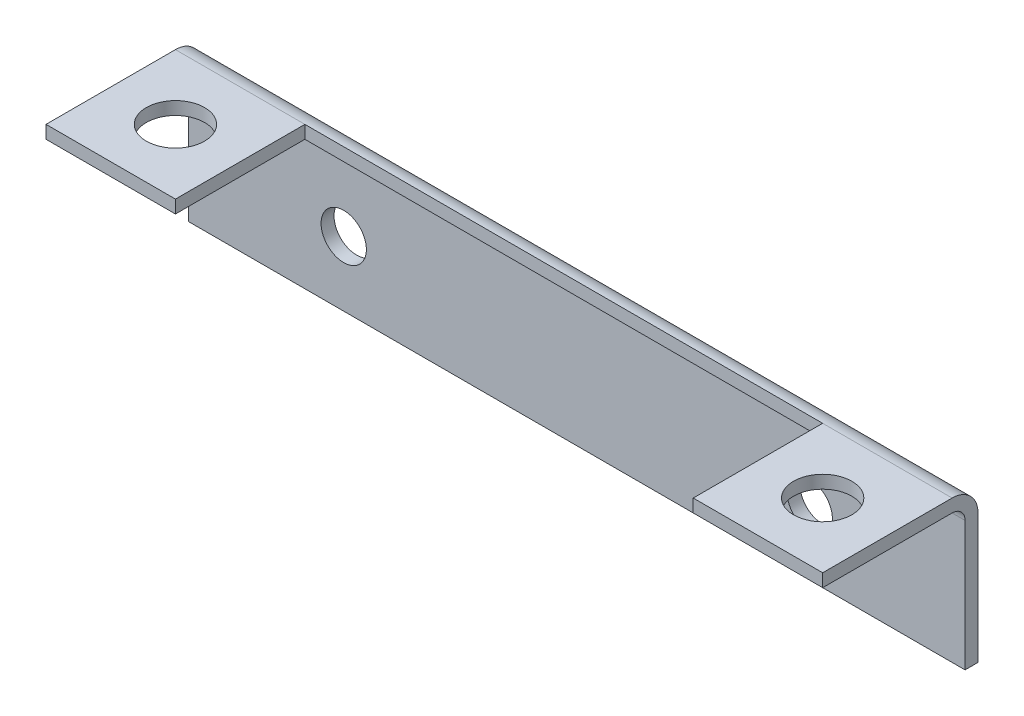
ISO-10303-21;
HEADER;
FILE_DESCRIPTION(('STEP AP214'),'2;1');
FILE_NAME('part.step','',(''),(''),'','','');
FILE_SCHEMA(('AUTOMOTIVE_DESIGN { 1 0 10303 214 1 1 1 1 }'));
ENDSEC;
DATA;
#1=APPLICATION_CONTEXT('core data for automotive mechanical design processes');
#2=APPLICATION_PROTOCOL_DEFINITION('international standard','automotive_design',2000,#1);
#3=PRODUCT_CONTEXT('',#1,'mechanical');
#4=PRODUCT('Part','Part','',(#3));
#5=PRODUCT_RELATED_PRODUCT_CATEGORY('part','',(#4));
#6=PRODUCT_DEFINITION_FORMATION('','',#4);
#7=PRODUCT_DEFINITION_CONTEXT('part definition',#1,'design');
#8=PRODUCT_DEFINITION('design','',#6,#7);
#9=PRODUCT_DEFINITION_SHAPE('','',#8);
#10=(LENGTH_UNIT() NAMED_UNIT(*) SI_UNIT(.MILLI.,.METRE.));
#11=(NAMED_UNIT(*) PLANE_ANGLE_UNIT() SI_UNIT($,.RADIAN.));
#12=(NAMED_UNIT(*) SI_UNIT($,.STERADIAN.) SOLID_ANGLE_UNIT());
#13=UNCERTAINTY_MEASURE_WITH_UNIT(LENGTH_MEASURE(1.E-05),#10,'distance_accuracy_value','');
#14=(GEOMETRIC_REPRESENTATION_CONTEXT(3) GLOBAL_UNCERTAINTY_ASSIGNED_CONTEXT((#13)) GLOBAL_UNIT_ASSIGNED_CONTEXT((#10,
#11,#12)) REPRESENTATION_CONTEXT('',''));
#15=CARTESIAN_POINT('',(0.,0.,0.));
#16=DIRECTION('',(0.,0.,1.));
#17=DIRECTION('',(1.,0.,0.));
#18=AXIS2_PLACEMENT_3D('',#15,#16,#17);
#19=CARTESIAN_POINT('',(0.,6.,5.86902664470768));
#20=DIRECTION('',(0.,-1.,0.));
#21=DIRECTION('',(0.,0.,-1.));
#22=AXIS2_PLACEMENT_3D('',#19,#20,#21);
#23=PLANE('',#22);
#24=CARTESIAN_POINT('',(25.,6.,6.99999999999999));
#25=DIRECTION('',(0.,1.,0.));
#26=DIRECTION('',(0.,0.,1.));
#27=AXIS2_PLACEMENT_3D('',#24,#25,#26);
#28=CIRCLE('',#27,2.25);
#29=CARTESIAN_POINT('',(25.,6.,9.24999999999999));
#30=VERTEX_POINT('',#29);
#31=EDGE_CURVE('E19',#30,#30,#28,.T.);
#32=ORIENTED_EDGE('',*,*,#31,.T.);
#33=EDGE_LOOP('',(#32));
#34=FACE_BOUND('',#33,.T.);
#35=DIRECTION('',(0.,0.,-1.));
#36=VECTOR('',#35,1.);
#37=CARTESIAN_POINT('',(30.,6.,2.));
#38=LINE('',#37,#36);
#39=CARTESIAN_POINT('',(30.,6.,12.));
#40=VERTEX_POINT('',#39);
#41=CARTESIAN_POINT('',(30.,5.99999999999999,2.));
#42=VERTEX_POINT('',#41);
#43=EDGE_CURVE('E59',#40,#42,#38,.T.);
#44=ORIENTED_EDGE('',*,*,#43,.F.);
#45=DIRECTION('',(1.,0.,0.));
#46=VECTOR('',#45,1.);
#47=CARTESIAN_POINT('',(30.,6.,12.));
#48=LINE('',#47,#46);
#49=CARTESIAN_POINT('',(20.,6.,12.));
#50=VERTEX_POINT('',#49);
#51=EDGE_CURVE('E68',#50,#40,#48,.T.);
#52=ORIENTED_EDGE('',*,*,#51,.F.);
#53=DIRECTION('',(0.,0.,-1.));
#54=VECTOR('',#53,1.);
#55=CARTESIAN_POINT('',(20.,6.,2.));
#56=LINE('',#55,#54);
#57=CARTESIAN_POINT('',(20.,5.99999999999999,2.));
#58=VERTEX_POINT('',#57);
#59=EDGE_CURVE('E247',#50,#58,#56,.T.);
#60=ORIENTED_EDGE('',*,*,#59,.T.);
#61=DIRECTION('',(1.,0.,0.));
#62=VECTOR('',#61,1.);
#63=CARTESIAN_POINT('',(0.,5.99999999999999,2.));
#64=LINE('',#63,#62);
#65=EDGE_CURVE('E235',#58,#42,#64,.T.);
#66=ORIENTED_EDGE('',*,*,#65,.T.);
#67=EDGE_LOOP('',(#44,#52,#60,#66));
#68=FACE_BOUND('',#67,.T.);
#69=ADVANCED_FACE('F16',(#34,#68),#23,.T.);
#70=CARTESIAN_POINT('',(0.,6.,5.86902664470768));
#71=DIRECTION('',(0.,-1.,0.));
#72=DIRECTION('',(0.,0.,-1.));
#73=AXIS2_PLACEMENT_3D('',#70,#71,#72);
#74=PLANE('',#73);
#75=CARTESIAN_POINT('',(-25.,6.,6.99999999999999));
#76=DIRECTION('',(0.,1.,0.));
#77=DIRECTION('',(0.,0.,1.));
#78=AXIS2_PLACEMENT_3D('',#75,#76,#77);
#79=CIRCLE('',#78,2.25);
#80=CARTESIAN_POINT('',(-25.,6.,9.24999999999999));
#81=VERTEX_POINT('',#80);
#82=EDGE_CURVE('E224',#81,#81,#79,.T.);
#83=ORIENTED_EDGE('',*,*,#82,.T.);
#84=EDGE_LOOP('',(#83));
#85=FACE_BOUND('',#84,.T.);
#86=DIRECTION('',(0.,0.,1.));
#87=VECTOR('',#86,1.);
#88=CARTESIAN_POINT('',(-30.,5.99999999999999,2.));
#89=LINE('',#88,#87);
#90=CARTESIAN_POINT('',(-30.,5.99999999999999,2.));
#91=VERTEX_POINT('',#90);
#92=CARTESIAN_POINT('',(-30.,5.99999999999999,12.));
#93=VERTEX_POINT('',#92);
#94=EDGE_CURVE('E214',#91,#93,#89,.T.);
#95=ORIENTED_EDGE('',*,*,#94,.F.);
#96=DIRECTION('',(1.,0.,0.));
#97=VECTOR('',#96,1.);
#98=CARTESIAN_POINT('',(0.,5.99999999999999,2.));
#99=LINE('',#98,#97);
#100=CARTESIAN_POINT('',(-20.,5.99999999999999,2.));
#101=VERTEX_POINT('',#100);
#102=EDGE_CURVE('E181',#91,#101,#99,.T.);
#103=ORIENTED_EDGE('',*,*,#102,.T.);
#104=DIRECTION('',(0.,0.,1.));
#105=VECTOR('',#104,1.);
#106=CARTESIAN_POINT('',(-20.,5.99999999999999,12.));
#107=LINE('',#106,#105);
#108=CARTESIAN_POINT('',(-20.,5.99999999999999,12.));
#109=VERTEX_POINT('',#108);
#110=EDGE_CURVE('E225',#101,#109,#107,.T.);
#111=ORIENTED_EDGE('',*,*,#110,.T.);
#112=DIRECTION('',(1.,0.,0.));
#113=VECTOR('',#112,1.);
#114=CARTESIAN_POINT('',(30.,6.,12.));
#115=LINE('',#114,#113);
#116=EDGE_CURVE('E118',#93,#109,#115,.T.);
#117=ORIENTED_EDGE('',*,*,#116,.F.);
#118=EDGE_LOOP('',(#95,#103,#111,#117));
#119=FACE_BOUND('',#118,.T.);
#120=ADVANCED_FACE('F301',(#85,#119),#74,.T.);
#121=CARTESIAN_POINT('',(30.,6.,12.));
#122=DIRECTION('',(0.,0.,1.));
#123=DIRECTION('',(0.,-1.,0.));
#124=AXIS2_PLACEMENT_3D('',#121,#122,#123);
#125=PLANE('',#124);
#126=DIRECTION('',(0.,-1.,0.));
#127=VECTOR('',#126,1.);
#128=CARTESIAN_POINT('',(30.,6.,12.));
#129=LINE('',#128,#127);
#130=CARTESIAN_POINT('',(30.,7.00000000000001,12.));
#131=VERTEX_POINT('',#130);
#132=EDGE_CURVE('E111',#40,#131,#129,.F.);
#133=ORIENTED_EDGE('',*,*,#132,.T.);
#134=DIRECTION('',(1.,0.,0.));
#135=VECTOR('',#134,1.);
#136=CARTESIAN_POINT('',(0.,7.00000000000001,12.));
#137=LINE('',#136,#135);
#138=CARTESIAN_POINT('',(20.,7.00000000000001,12.));
#139=VERTEX_POINT('',#138);
#140=EDGE_CURVE('E180',#131,#139,#137,.F.);
#141=ORIENTED_EDGE('',*,*,#140,.T.);
#142=DIRECTION('',(0.,1.,0.));
#143=VECTOR('',#142,1.);
#144=CARTESIAN_POINT('',(20.,6.99999999999999,12.));
#145=LINE('',#144,#143);
#146=EDGE_CURVE('E250',#139,#50,#145,.F.);
#147=ORIENTED_EDGE('',*,*,#146,.T.);
#148=ORIENTED_EDGE('',*,*,#51,.T.);
#149=EDGE_LOOP('',(#133,#141,#147,#148));
#150=FACE_BOUND('',#149,.T.);
#151=ADVANCED_FACE('F378',(#150),#125,.T.);
#152=CARTESIAN_POINT('',(20.,6.99999999999999,2.));
#153=DIRECTION('',(1.,0.,0.));
#154=DIRECTION('',(0.,0.,-1.));
#155=AXIS2_PLACEMENT_3D('',#152,#153,#154);
#156=PLANE('',#155);
#157=DIRECTION('',(0.,1.,0.));
#158=VECTOR('',#157,1.);
#159=CARTESIAN_POINT('',(20.,6.99999999999999,2.));
#160=LINE('',#159,#158);
#161=CARTESIAN_POINT('',(20.,6.99999999999999,2.));
#162=VERTEX_POINT('',#161);
#163=EDGE_CURVE('E98',#58,#162,#160,.T.);
#164=ORIENTED_EDGE('',*,*,#163,.F.);
#165=ORIENTED_EDGE('',*,*,#59,.F.);
#166=ORIENTED_EDGE('',*,*,#146,.F.);
#167=DIRECTION('',(0.,0.,-1.));
#168=VECTOR('',#167,1.);
#169=CARTESIAN_POINT('',(20.,7.,5.86902664470768));
#170=LINE('',#169,#168);
#171=EDGE_CURVE('E184',#139,#162,#170,.T.);
#172=ORIENTED_EDGE('',*,*,#171,.T.);
#173=EDGE_LOOP('',(#164,#165,#166,#172));
#174=FACE_BOUND('',#173,.T.);
#175=ADVANCED_FACE('F377',(#174),#156,.F.);
#176=CARTESIAN_POINT('',(25.,6.,6.99999999999999));
#177=DIRECTION('',(0.,1.,0.));
#178=DIRECTION('',(0.,0.,1.));
#179=AXIS2_PLACEMENT_3D('',#176,#177,#178);
#180=CYLINDRICAL_SURFACE('',#179,2.25);
#181=CARTESIAN_POINT('',(25.,7.,6.99999999999999));
#182=DIRECTION('',(0.,1.,0.));
#183=DIRECTION('',(0.,0.,1.));
#184=AXIS2_PLACEMENT_3D('',#181,#182,#183);
#185=CIRCLE('',#184,2.25);
#186=CARTESIAN_POINT('',(25.,7.,9.24999999999999));
#187=VERTEX_POINT('',#186);
#188=EDGE_CURVE('E186',#187,#187,#185,.T.);
#189=ORIENTED_EDGE('',*,*,#188,.T.);
#190=EDGE_LOOP('',(#189));
#191=FACE_BOUND('',#190,.T.);
#192=ORIENTED_EDGE('',*,*,#31,.F.);
#193=EDGE_LOOP('',(#192));
#194=FACE_BOUND('',#193,.T.);
#195=ADVANCED_FACE('F385',(#191,#194),#180,.F.);
#196=CARTESIAN_POINT('',(30.,6.,12.));
#197=DIRECTION('',(0.,0.,1.));
#198=DIRECTION('',(0.,-1.,0.));
#199=AXIS2_PLACEMENT_3D('',#196,#197,#198);
#200=PLANE('',#199);
#201=DIRECTION('',(0.,1.,0.));
#202=VECTOR('',#201,1.);
#203=CARTESIAN_POINT('',(-30.,5.99999999999999,12.));
#204=LINE('',#203,#202);
#205=CARTESIAN_POINT('',(-30.,7.00000000000001,12.));
#206=VERTEX_POINT('',#205);
#207=EDGE_CURVE('E211',#93,#206,#204,.T.);
#208=ORIENTED_EDGE('',*,*,#207,.F.);
#209=ORIENTED_EDGE('',*,*,#116,.T.);
#210=DIRECTION('',(0.,1.,0.));
#211=VECTOR('',#210,1.);
#212=CARTESIAN_POINT('',(-20.,7.,12.));
#213=LINE('',#212,#211);
#214=CARTESIAN_POINT('',(-20.,7.00000000000001,12.));
#215=VERTEX_POINT('',#214);
#216=EDGE_CURVE('E222',#109,#215,#213,.T.);
#217=ORIENTED_EDGE('',*,*,#216,.T.);
#218=DIRECTION('',(1.,0.,0.));
#219=VECTOR('',#218,1.);
#220=CARTESIAN_POINT('',(0.,7.00000000000001,12.));
#221=LINE('',#220,#219);
#222=EDGE_CURVE('E165',#215,#206,#221,.F.);
#223=ORIENTED_EDGE('',*,*,#222,.T.);
#224=EDGE_LOOP('',(#208,#209,#217,#223));
#225=FACE_BOUND('',#224,.T.);
#226=ADVANCED_FACE('F318',(#225),#200,.T.);
#227=CARTESIAN_POINT('',(-20.,7.,12.));
#228=DIRECTION('',(-1.,0.,0.));
#229=DIRECTION('',(0.,0.,1.));
#230=AXIS2_PLACEMENT_3D('',#227,#228,#229);
#231=PLANE('',#230);
#232=ORIENTED_EDGE('',*,*,#216,.F.);
#233=ORIENTED_EDGE('',*,*,#110,.F.);
#234=DIRECTION('',(0.,1.,0.));
#235=VECTOR('',#234,1.);
#236=CARTESIAN_POINT('',(-20.,7.,2.));
#237=LINE('',#236,#235);
#238=CARTESIAN_POINT('',(-20.,6.99999999999999,2.));
#239=VERTEX_POINT('',#238);
#240=EDGE_CURVE('E213',#239,#101,#237,.F.);
#241=ORIENTED_EDGE('',*,*,#240,.F.);
#242=DIRECTION('',(0.,0.,-1.));
#243=VECTOR('',#242,1.);
#244=CARTESIAN_POINT('',(-20.,7.,5.86902664470768));
#245=LINE('',#244,#243);
#246=EDGE_CURVE('E164',#239,#215,#245,.F.);
#247=ORIENTED_EDGE('',*,*,#246,.T.);
#248=EDGE_LOOP('',(#232,#233,#241,#247));
#249=FACE_BOUND('',#248,.T.);
#250=ADVANCED_FACE('F307',(#249),#231,.F.);
#251=CARTESIAN_POINT('',(-25.,6.,6.99999999999999));
#252=DIRECTION('',(0.,1.,0.));
#253=DIRECTION('',(0.,0.,1.));
#254=AXIS2_PLACEMENT_3D('',#251,#252,#253);
#255=CYLINDRICAL_SURFACE('',#254,2.25);
#256=CARTESIAN_POINT('',(-25.,7.,6.99999999999999));
#257=DIRECTION('',(0.,1.,0.));
#258=DIRECTION('',(0.,0.,1.));
#259=AXIS2_PLACEMENT_3D('',#256,#257,#258);
#260=CIRCLE('',#259,2.25);
#261=CARTESIAN_POINT('',(-25.,7.,9.24999999999999));
#262=VERTEX_POINT('',#261);
#263=EDGE_CURVE('E230',#262,#262,#260,.T.);
#264=ORIENTED_EDGE('',*,*,#263,.T.);
#265=EDGE_LOOP('',(#264));
#266=FACE_BOUND('',#265,.T.);
#267=ORIENTED_EDGE('',*,*,#82,.F.);
#268=EDGE_LOOP('',(#267));
#269=FACE_BOUND('',#268,.T.);
#270=ADVANCED_FACE('F304',(#266,#269),#255,.F.);
#271=CARTESIAN_POINT('',(0.,4.99999999999999,2.));
#272=DIRECTION('',(1.,0.,0.));
#273=DIRECTION('',(0.,0.,-1.));
#274=AXIS2_PLACEMENT_3D('',#271,#272,#273);
#275=CYLINDRICAL_SURFACE('',#274,0.999999999999999);
#276=CARTESIAN_POINT('',(-30.,4.99999999999999,2.));
#277=DIRECTION('',(1.,0.,0.));
#278=DIRECTION('',(0.,0.,-1.));
#279=AXIS2_PLACEMENT_3D('',#276,#277,#278);
#280=CIRCLE('',#279,0.999999999999999);
#281=CARTESIAN_POINT('',(-30.,4.99999999999999,1.));
#282=VERTEX_POINT('',#281);
#283=EDGE_CURVE('E219',#282,#91,#280,.T.);
#284=ORIENTED_EDGE('',*,*,#283,.F.);
#285=DIRECTION('',(1.,0.,0.));
#286=VECTOR('',#285,1.);
#287=CARTESIAN_POINT('',(0.,4.99999999999999,1.));
#288=LINE('',#287,#286);
#289=CARTESIAN_POINT('',(30.,4.99999999999999,1.));
#290=VERTEX_POINT('',#289);
#291=EDGE_CURVE('E196',#290,#282,#288,.F.);
#292=ORIENTED_EDGE('',*,*,#291,.F.);
#293=CARTESIAN_POINT('',(30.,4.99999999999999,2.));
#294=DIRECTION('',(1.,0.,0.));
#295=DIRECTION('',(0.,0.,-1.));
#296=AXIS2_PLACEMENT_3D('',#293,#294,#295);
#297=CIRCLE('',#296,0.999999999999999);
#298=EDGE_CURVE('E295',#42,#290,#297,.F.);
#299=ORIENTED_EDGE('',*,*,#298,.F.);
#300=ORIENTED_EDGE('',*,*,#65,.F.);
#301=DIRECTION('',(1.,0.,0.));
#302=VECTOR('',#301,1.);
#303=CARTESIAN_POINT('',(-20.,5.99999999999999,2.));
#304=LINE('',#303,#302);
#305=EDGE_CURVE('E199',#58,#101,#304,.F.);
#306=ORIENTED_EDGE('',*,*,#305,.T.);
#307=ORIENTED_EDGE('',*,*,#102,.F.);
#308=EDGE_LOOP('',(#284,#292,#299,#300,#306,#307));
#309=FACE_BOUND('',#308,.T.);
#310=ADVANCED_FACE('F306',(#309),#275,.F.);
#311=CARTESIAN_POINT('',(0.,7.,5.86902664470768));
#312=DIRECTION('',(0.,-1.,0.));
#313=DIRECTION('',(0.,0.,-1.));
#314=AXIS2_PLACEMENT_3D('',#311,#312,#313);
#315=PLANE('',#314);
#316=ORIENTED_EDGE('',*,*,#188,.F.);
#317=EDGE_LOOP('',(#316));
#318=FACE_BOUND('',#317,.T.);
#319=ORIENTED_EDGE('',*,*,#140,.F.);
#320=DIRECTION('',(0.,0.,-1.));
#321=VECTOR('',#320,1.);
#322=CARTESIAN_POINT('',(30.,7.,5.86902664470768));
#323=LINE('',#322,#321);
#324=CARTESIAN_POINT('',(30.,6.99999999999999,2.));
#325=VERTEX_POINT('',#324);
#326=EDGE_CURVE('E90',#325,#131,#323,.F.);
#327=ORIENTED_EDGE('',*,*,#326,.F.);
#328=DIRECTION('',(1.,0.,0.));
#329=VECTOR('',#328,1.);
#330=CARTESIAN_POINT('',(0.,6.99999999999999,2.));
#331=LINE('',#330,#329);
#332=EDGE_CURVE('E173',#162,#325,#331,.T.);
#333=ORIENTED_EDGE('',*,*,#332,.F.);
#334=ORIENTED_EDGE('',*,*,#171,.F.);
#335=EDGE_LOOP('',(#319,#327,#333,#334));
#336=FACE_BOUND('',#335,.T.);
#337=ADVANCED_FACE('F315',(#318,#336),#315,.F.);
#338=CARTESIAN_POINT('',(0.,7.,5.86902664470768));
#339=DIRECTION('',(0.,-1.,0.));
#340=DIRECTION('',(0.,0.,-1.));
#341=AXIS2_PLACEMENT_3D('',#338,#339,#340);
#342=PLANE('',#341);
#343=ORIENTED_EDGE('',*,*,#263,.F.);
#344=EDGE_LOOP('',(#343));
#345=FACE_BOUND('',#344,.T.);
#346=DIRECTION('',(1.,0.,0.));
#347=VECTOR('',#346,1.);
#348=CARTESIAN_POINT('',(0.,6.99999999999999,2.));
#349=LINE('',#348,#347);
#350=CARTESIAN_POINT('',(-30.,6.99999999999999,2.));
#351=VERTEX_POINT('',#350);
#352=EDGE_CURVE('E168',#351,#239,#349,.T.);
#353=ORIENTED_EDGE('',*,*,#352,.F.);
#354=DIRECTION('',(0.,0.,-1.));
#355=VECTOR('',#354,1.);
#356=CARTESIAN_POINT('',(-30.,7.,5.86902664470768));
#357=LINE('',#356,#355);
#358=EDGE_CURVE('E162',#206,#351,#357,.T.);
#359=ORIENTED_EDGE('',*,*,#358,.F.);
#360=ORIENTED_EDGE('',*,*,#222,.F.);
#361=ORIENTED_EDGE('',*,*,#246,.F.);
#362=EDGE_LOOP('',(#353,#359,#360,#361));
#363=FACE_BOUND('',#362,.T.);
#364=ADVANCED_FACE('F354',(#345,#363),#342,.F.);
#365=CARTESIAN_POINT('',(-20.,6.99999999999999,2.));
#366=DIRECTION('',(0.,0.,-1.));
#367=DIRECTION('',(0.,1.,0.));
#368=AXIS2_PLACEMENT_3D('',#365,#366,#367);
#369=PLANE('',#368);
#370=ORIENTED_EDGE('',*,*,#240,.T.);
#371=ORIENTED_EDGE('',*,*,#305,.F.);
#372=ORIENTED_EDGE('',*,*,#163,.T.);
#373=DIRECTION('',(1.,0.,0.));
#374=VECTOR('',#373,1.);
#375=CARTESIAN_POINT('',(0.,6.99999999999999,2.));
#376=LINE('',#375,#374);
#377=EDGE_CURVE('E170',#239,#162,#376,.T.);
#378=ORIENTED_EDGE('',*,*,#377,.F.);
#379=EDGE_LOOP('',(#370,#371,#372,#378));
#380=FACE_BOUND('',#379,.T.);
#381=ADVANCED_FACE('F350',(#380),#369,.F.);
#382=CARTESIAN_POINT('',(0.,0.,1.));
#383=DIRECTION('',(0.,0.,1.));
#384=DIRECTION('',(1.,0.,0.));
#385=AXIS2_PLACEMENT_3D('',#382,#383,#384);
#386=PLANE('',#385);
#387=CARTESIAN_POINT('',(-18.,0.,1.));
#388=DIRECTION('',(0.,0.,1.));
#389=DIRECTION('',(1.,0.,0.));
#390=AXIS2_PLACEMENT_3D('',#387,#388,#389);
#391=CIRCLE('',#390,1.75);
#392=CARTESIAN_POINT('',(-16.25,0.,1.));
#393=VERTEX_POINT('',#392);
#394=EDGE_CURVE('E154',#393,#393,#391,.F.);
#395=ORIENTED_EDGE('',*,*,#394,.T.);
#396=EDGE_LOOP('',(#395));
#397=FACE_BOUND('',#396,.T.);
#398=CARTESIAN_POINT('',(18.,0.,1.));
#399=DIRECTION('',(0.,0.,1.));
#400=DIRECTION('',(1.,0.,0.));
#401=AXIS2_PLACEMENT_3D('',#398,#399,#400);
#402=CIRCLE('',#401,1.75);
#403=CARTESIAN_POINT('',(19.75,0.,1.));
#404=VERTEX_POINT('',#403);
#405=EDGE_CURVE('E157',#404,#404,#402,.F.);
#406=ORIENTED_EDGE('',*,*,#405,.T.);
#407=EDGE_LOOP('',(#406));
#408=FACE_BOUND('',#407,.T.);
#409=DIRECTION('',(0.,-1.,0.));
#410=VECTOR('',#409,1.);
#411=CARTESIAN_POINT('',(-30.,-5.00000000000002,1.));
#412=LINE('',#411,#410);
#413=CARTESIAN_POINT('',(-30.,-5.00000000000002,1.));
#414=VERTEX_POINT('',#413);
#415=EDGE_CURVE('E198',#414,#282,#412,.F.);
#416=ORIENTED_EDGE('',*,*,#415,.F.);
#417=DIRECTION('',(1.,0.,0.));
#418=VECTOR('',#417,1.);
#419=CARTESIAN_POINT('',(30.,-5.00000000000001,1.));
#420=LINE('',#419,#418);
#421=CARTESIAN_POINT('',(30.,-5.00000000000001,1.));
#422=VERTEX_POINT('',#421);
#423=EDGE_CURVE('E139',#422,#414,#420,.F.);
#424=ORIENTED_EDGE('',*,*,#423,.F.);
#425=DIRECTION('',(0.,1.,0.));
#426=VECTOR('',#425,1.);
#427=CARTESIAN_POINT('',(30.,4.99999999999999,1.));
#428=LINE('',#427,#426);
#429=EDGE_CURVE('E144',#290,#422,#428,.F.);
#430=ORIENTED_EDGE('',*,*,#429,.F.);
#431=ORIENTED_EDGE('',*,*,#291,.T.);
#432=EDGE_LOOP('',(#416,#424,#430,#431));
#433=FACE_BOUND('',#432,.T.);
#434=ADVANCED_FACE('F347',(#397,#408,#433),#386,.T.);
#435=CARTESIAN_POINT('',(-30.,-5.00000000000002,0.));
#436=DIRECTION('',(-1.,0.,0.));
#437=DIRECTION('',(0.,-1.,0.));
#438=AXIS2_PLACEMENT_3D('',#435,#436,#437);
#439=PLANE('',#438);
#440=DIRECTION('',(0.,1.,0.));
#441=VECTOR('',#440,1.);
#442=CARTESIAN_POINT('',(-30.,0.,0.));
#443=LINE('',#442,#441);
#444=CARTESIAN_POINT('',(-30.,4.99999999999999,0.));
#445=VERTEX_POINT('',#444);
#446=CARTESIAN_POINT('',(-30.,-5.00000000000002,0.));
#447=VERTEX_POINT('',#446);
#448=EDGE_CURVE('E149',#445,#447,#443,.F.);
#449=ORIENTED_EDGE('',*,*,#448,.T.);
#450=DIRECTION('',(0.,0.,1.));
#451=VECTOR('',#450,1.);
#452=CARTESIAN_POINT('',(-30.,-5.00000000000002,0.));
#453=LINE('',#452,#451);
#454=EDGE_CURVE('E133',#414,#447,#453,.F.);
#455=ORIENTED_EDGE('',*,*,#454,.F.);
#456=ORIENTED_EDGE('',*,*,#415,.T.);
#457=ORIENTED_EDGE('',*,*,#283,.T.);
#458=ORIENTED_EDGE('',*,*,#94,.T.);
#459=ORIENTED_EDGE('',*,*,#207,.T.);
#460=ORIENTED_EDGE('',*,*,#358,.T.);
#461=CARTESIAN_POINT('',(-30.,4.99999999999999,2.));
#462=DIRECTION('',(1.,0.,0.));
#463=DIRECTION('',(0.,0.,-1.));
#464=AXIS2_PLACEMENT_3D('',#461,#462,#463);
#465=CIRCLE('',#464,2.);
#466=EDGE_CURVE('E80',#445,#351,#465,.T.);
#467=ORIENTED_EDGE('',*,*,#466,.F.);
#468=EDGE_LOOP('',(#449,#455,#456,#457,#458,#459,#460,#467));
#469=FACE_BOUND('',#468,.T.);
#470=ADVANCED_FACE('F153',(#469),#439,.T.);
#471=CARTESIAN_POINT('',(30.,-5.00000000000001,0.));
#472=DIRECTION('',(0.,-1.,0.));
#473=DIRECTION('',(1.,0.,0.));
#474=AXIS2_PLACEMENT_3D('',#471,#472,#473);
#475=PLANE('',#474);
#476=DIRECTION('',(1.,0.,0.));
#477=VECTOR('',#476,1.);
#478=CARTESIAN_POINT('',(0.,-5.00000000000002,0.));
#479=LINE('',#478,#477);
#480=CARTESIAN_POINT('',(30.,-5.00000000000001,0.));
#481=VERTEX_POINT('',#480);
#482=EDGE_CURVE('E137',#447,#481,#479,.T.);
#483=ORIENTED_EDGE('',*,*,#482,.T.);
#484=DIRECTION('',(0.,0.,-1.));
#485=VECTOR('',#484,1.);
#486=CARTESIAN_POINT('',(30.,-5.00000000000001,0.));
#487=LINE('',#486,#485);
#488=EDGE_CURVE('E175',#422,#481,#487,.T.);
#489=ORIENTED_EDGE('',*,*,#488,.F.);
#490=ORIENTED_EDGE('',*,*,#423,.T.);
#491=ORIENTED_EDGE('',*,*,#454,.T.);
#492=EDGE_LOOP('',(#483,#489,#490,#491));
#493=FACE_BOUND('',#492,.T.);
#494=ADVANCED_FACE('F135',(#493),#475,.T.);
#495=CARTESIAN_POINT('',(30.,4.99999999999999,0.));
#496=DIRECTION('',(1.,0.,0.));
#497=DIRECTION('',(0.,0.,-1.));
#498=AXIS2_PLACEMENT_3D('',#495,#496,#497);
#499=PLANE('',#498);
#500=DIRECTION('',(0.,1.,0.));
#501=VECTOR('',#500,1.);
#502=CARTESIAN_POINT('',(30.,0.,0.));
#503=LINE('',#502,#501);
#504=CARTESIAN_POINT('',(30.,4.99999999999999,0.));
#505=VERTEX_POINT('',#504);
#506=EDGE_CURVE('E151',#481,#505,#503,.T.);
#507=ORIENTED_EDGE('',*,*,#506,.T.);
#508=CARTESIAN_POINT('',(30.,4.99999999999999,2.));
#509=DIRECTION('',(1.,0.,0.));
#510=DIRECTION('',(0.,0.,-1.));
#511=AXIS2_PLACEMENT_3D('',#508,#509,#510);
#512=CIRCLE('',#511,2.);
#513=EDGE_CURVE('E34',#325,#505,#512,.F.);
#514=ORIENTED_EDGE('',*,*,#513,.F.);
#515=ORIENTED_EDGE('',*,*,#326,.T.);
#516=ORIENTED_EDGE('',*,*,#132,.F.);
#517=ORIENTED_EDGE('',*,*,#43,.T.);
#518=ORIENTED_EDGE('',*,*,#298,.T.);
#519=ORIENTED_EDGE('',*,*,#429,.T.);
#520=ORIENTED_EDGE('',*,*,#488,.T.);
#521=EDGE_LOOP('',(#507,#514,#515,#516,#517,#518,#519,#520));
#522=FACE_BOUND('',#521,.T.);
#523=ADVANCED_FACE('F340',(#522),#499,.T.);
#524=CARTESIAN_POINT('',(0.,4.99999999999999,2.));
#525=DIRECTION('',(1.,0.,0.));
#526=DIRECTION('',(0.,0.,-1.));
#527=AXIS2_PLACEMENT_3D('',#524,#525,#526);
#528=CYLINDRICAL_SURFACE('',#527,2.);
#529=ORIENTED_EDGE('',*,*,#352,.T.);
#530=ORIENTED_EDGE('',*,*,#377,.T.);
#531=ORIENTED_EDGE('',*,*,#332,.T.);
#532=ORIENTED_EDGE('',*,*,#513,.T.);
#533=DIRECTION('',(1.,0.,0.));
#534=VECTOR('',#533,1.);
#535=CARTESIAN_POINT('',(0.,4.99999999999999,0.));
#536=LINE('',#535,#534);
#537=EDGE_CURVE('E160',#505,#445,#536,.F.);
#538=ORIENTED_EDGE('',*,*,#537,.T.);
#539=ORIENTED_EDGE('',*,*,#466,.T.);
#540=EDGE_LOOP('',(#529,#530,#531,#532,#538,#539));
#541=FACE_BOUND('',#540,.T.);
#542=ADVANCED_FACE('F336',(#541),#528,.T.);
#543=CARTESIAN_POINT('',(18.,0.,0.));
#544=DIRECTION('',(0.,0.,1.));
#545=DIRECTION('',(1.,0.,0.));
#546=AXIS2_PLACEMENT_3D('',#543,#544,#545);
#547=CYLINDRICAL_SURFACE('',#546,1.75);
#548=ORIENTED_EDGE('',*,*,#405,.F.);
#549=EDGE_LOOP('',(#548));
#550=FACE_BOUND('',#549,.T.);
#551=CARTESIAN_POINT('',(18.,0.,0.));
#552=DIRECTION('',(0.,0.,1.));
#553=DIRECTION('',(1.,0.,0.));
#554=AXIS2_PLACEMENT_3D('',#551,#552,#553);
#555=CIRCLE('',#554,1.75);
#556=CARTESIAN_POINT('',(19.75,0.,0.));
#557=VERTEX_POINT('',#556);
#558=EDGE_CURVE('E25',#557,#557,#555,.F.);
#559=ORIENTED_EDGE('',*,*,#558,.T.);
#560=EDGE_LOOP('',(#559));
#561=FACE_BOUND('',#560,.T.);
#562=ADVANCED_FACE('F328',(#550,#561),#547,.F.);
#563=CARTESIAN_POINT('',(-18.,0.,0.));
#564=DIRECTION('',(0.,0.,1.));
#565=DIRECTION('',(1.,0.,0.));
#566=AXIS2_PLACEMENT_3D('',#563,#564,#565);
#567=CYLINDRICAL_SURFACE('',#566,1.75);
#568=ORIENTED_EDGE('',*,*,#394,.F.);
#569=EDGE_LOOP('',(#568));
#570=FACE_BOUND('',#569,.T.);
#571=CARTESIAN_POINT('',(-18.,0.,0.));
#572=DIRECTION('',(0.,0.,1.));
#573=DIRECTION('',(1.,0.,0.));
#574=AXIS2_PLACEMENT_3D('',#571,#572,#573);
#575=CIRCLE('',#574,1.75);
#576=CARTESIAN_POINT('',(-16.25,0.,0.));
#577=VERTEX_POINT('',#576);
#578=EDGE_CURVE('E11',#577,#577,#575,.F.);
#579=ORIENTED_EDGE('',*,*,#578,.T.);
#580=EDGE_LOOP('',(#579));
#581=FACE_BOUND('',#580,.T.);
#582=ADVANCED_FACE('F322',(#570,#581),#567,.F.);
#583=CARTESIAN_POINT('',(0.,0.,0.));
#584=DIRECTION('',(0.,0.,1.));
#585=DIRECTION('',(1.,0.,0.));
#586=AXIS2_PLACEMENT_3D('',#583,#584,#585);
#587=PLANE('',#586);
#588=ORIENTED_EDGE('',*,*,#578,.F.);
#589=EDGE_LOOP('',(#588));
#590=FACE_BOUND('',#589,.T.);
#591=ORIENTED_EDGE('',*,*,#558,.F.);
#592=EDGE_LOOP('',(#591));
#593=FACE_BOUND('',#592,.T.);
#594=ORIENTED_EDGE('',*,*,#506,.F.);
#595=ORIENTED_EDGE('',*,*,#482,.F.);
#596=ORIENTED_EDGE('',*,*,#448,.F.);
#597=ORIENTED_EDGE('',*,*,#537,.F.);
#598=EDGE_LOOP('',(#594,#595,#596,#597));
#599=FACE_BOUND('',#598,.T.);
#600=ADVANCED_FACE('F148',(#590,#593,#599),#587,.F.);
#601=CLOSED_SHELL('',(#69,#120,#151,#175,#195,#226,#250,#270,#310,#337,#364,#381,#434,#470,#494,
#523,#542,#562,#582,#600));
#602=MANIFOLD_SOLID_BREP('B1',#601);
#603=ADVANCED_BREP_SHAPE_REPRESENTATION('',(#18,#602),#14);
#604=SHAPE_DEFINITION_REPRESENTATION(#9,#603);
ENDSEC;
END-ISO-10303-21;
